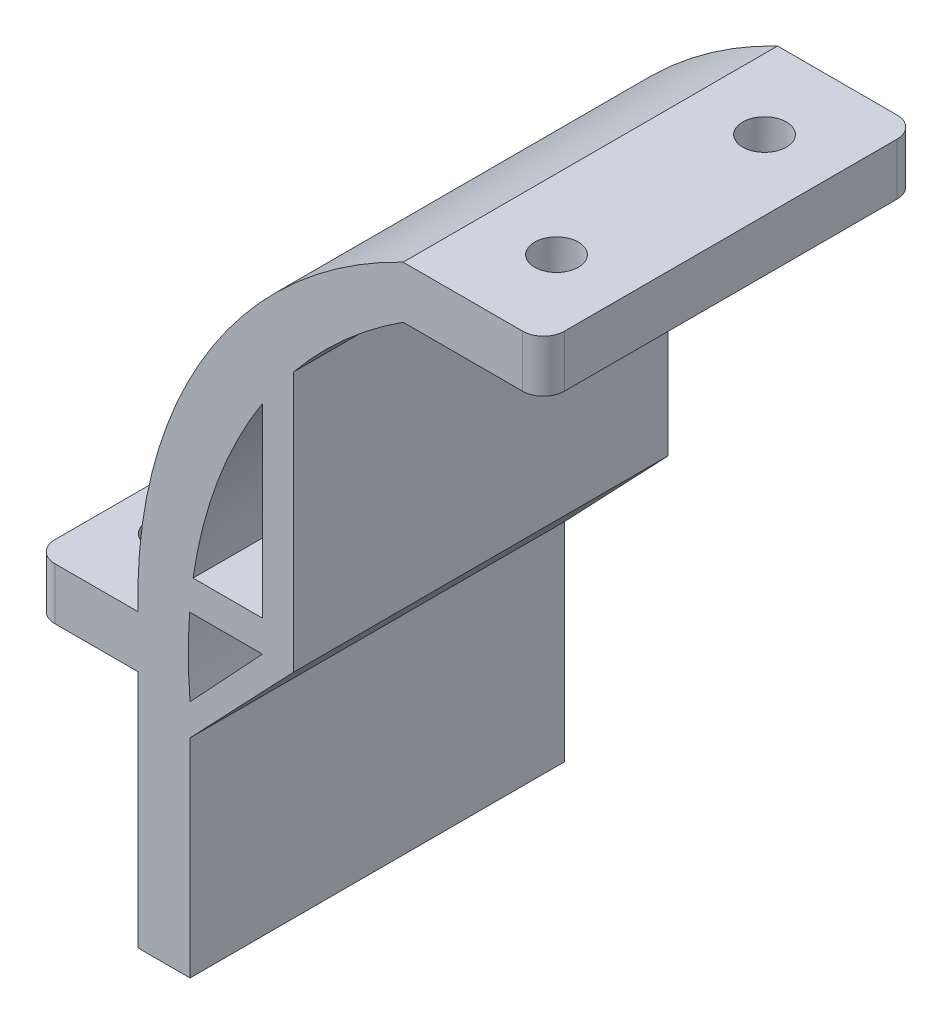
ISO-10303-21;
HEADER;
FILE_DESCRIPTION(('STEP AP214'),'2;1');
FILE_NAME('part.step','',(''),(''),'','','');
FILE_SCHEMA(('AUTOMOTIVE_DESIGN { 1 0 10303 214 1 1 1 1 }'));
ENDSEC;
DATA;
#1=APPLICATION_CONTEXT('core data for automotive mechanical design processes');
#2=APPLICATION_PROTOCOL_DEFINITION('international standard','automotive_design',2000,#1);
#3=PRODUCT_CONTEXT('',#1,'mechanical');
#4=PRODUCT('Part','Part','',(#3));
#5=PRODUCT_RELATED_PRODUCT_CATEGORY('part','',(#4));
#6=PRODUCT_DEFINITION_FORMATION('','',#4);
#7=PRODUCT_DEFINITION_CONTEXT('part definition',#1,'design');
#8=PRODUCT_DEFINITION('design','',#6,#7);
#9=PRODUCT_DEFINITION_SHAPE('','',#8);
#10=(LENGTH_UNIT() NAMED_UNIT(*) SI_UNIT(.MILLI.,.METRE.));
#11=(NAMED_UNIT(*) PLANE_ANGLE_UNIT() SI_UNIT($,.RADIAN.));
#12=(NAMED_UNIT(*) SI_UNIT($,.STERADIAN.) SOLID_ANGLE_UNIT());
#13=UNCERTAINTY_MEASURE_WITH_UNIT(LENGTH_MEASURE(1.E-05),#10,'distance_accuracy_value','');
#14=(GEOMETRIC_REPRESENTATION_CONTEXT(3) GLOBAL_UNCERTAINTY_ASSIGNED_CONTEXT((#13)) GLOBAL_UNIT_ASSIGNED_CONTEXT((#10,
#11,#12)) REPRESENTATION_CONTEXT('',''));
#15=CARTESIAN_POINT('',(0.,0.,0.));
#16=DIRECTION('',(0.,0.,1.));
#17=DIRECTION('',(1.,0.,0.));
#18=AXIS2_PLACEMENT_3D('',#15,#16,#17);
#19=CARTESIAN_POINT('',(19.2704077275692,219.412639915224,45.));
#20=DIRECTION('',(0.,0.,-1.));
#21=DIRECTION('',(-1.,0.,0.));
#22=AXIS2_PLACEMENT_3D('',#19,#20,#21);
#23=CYLINDRICAL_SURFACE('',#22,45.);
#24=CARTESIAN_POINT('',(19.2704077275692,219.412639915224,36.));
#25=DIRECTION('',(0.,0.,-1.));
#26=DIRECTION('',(-1.,0.,0.));
#27=AXIS2_PLACEMENT_3D('',#24,#25,#26);
#28=CIRCLE('',#27,45.);
#29=CARTESIAN_POINT('',(-25.2653617340679,225.859750776681,36.));
#30=VERTEX_POINT('',#29);
#31=CARTESIAN_POINT('',(-18.5973694260722,243.723778379767,36.));
#32=VERTEX_POINT('',#31);
#33=EDGE_CURVE('E315',#30,#32,#28,.T.);
#34=ORIENTED_EDGE('',*,*,#33,.F.);
#35=DIRECTION('',(0.,0.,1.));
#36=VECTOR('',#35,1.);
#37=CARTESIAN_POINT('',(-25.2653617340679,225.859750776681,0.));
#38=LINE('',#37,#36);
#39=CARTESIAN_POINT('',(-25.2653617340679,225.859750776681,0.));
#40=VERTEX_POINT('',#39);
#41=EDGE_CURVE('E404',#40,#30,#38,.T.);
#42=ORIENTED_EDGE('',*,*,#41,.F.);
#43=CARTESIAN_POINT('',(19.2704077275692,219.412639915224,0.));
#44=DIRECTION('',(0.,0.,1.));
#45=DIRECTION('',(1.,0.,0.));
#46=AXIS2_PLACEMENT_3D('',#43,#44,#45);
#47=CIRCLE('',#46,45.);
#48=CARTESIAN_POINT('',(-18.5973694260722,243.723778379767,0.));
#49=VERTEX_POINT('',#48);
#50=EDGE_CURVE('E416',#49,#40,#47,.T.);
#51=ORIENTED_EDGE('',*,*,#50,.F.);
#52=DIRECTION('',(0.,0.,1.));
#53=VECTOR('',#52,1.);
#54=CARTESIAN_POINT('',(-18.5973694260722,243.723778379767,0.));
#55=LINE('',#54,#53);
#56=EDGE_CURVE('E379',#49,#32,#55,.T.);
#57=ORIENTED_EDGE('',*,*,#56,.T.);
#58=EDGE_LOOP('',(#34,#42,#51,#57));
#59=FACE_BOUND('',#58,.T.);
#60=ADVANCED_FACE('F41',(#59),#23,.F.);
#61=CARTESIAN_POINT('',(19.2704077275692,219.412639915224,36.));
#62=DIRECTION('',(0.,0.,-1.));
#63=DIRECTION('',(-1.,0.,0.));
#64=AXIS2_PLACEMENT_3D('',#61,#62,#63);
#65=CIRCLE('',#64,45.);
#66=CARTESIAN_POINT('',(-25.5516147708674,215.414352888303,36.));
#67=VERTEX_POINT('',#66);
#68=CARTESIAN_POINT('',(-25.5973694260722,222.859750776681,36.));
#69=VERTEX_POINT('',#68);
#70=EDGE_CURVE('E324',#67,#69,#65,.T.);
#71=ORIENTED_EDGE('',*,*,#70,.F.);
#72=DIRECTION('',(0.,0.,-1.));
#73=VECTOR('',#72,1.);
#74=CARTESIAN_POINT('',(-25.5516147708674,215.414352888303,45.));
#75=LINE('',#74,#73);
#76=CARTESIAN_POINT('',(-25.5516147708674,215.414352888303,0.));
#77=VERTEX_POINT('',#76);
#78=EDGE_CURVE('E445',#67,#77,#75,.T.);
#79=ORIENTED_EDGE('',*,*,#78,.T.);
#80=CARTESIAN_POINT('',(-25.5973694260722,222.859750776681,0.));
#81=VERTEX_POINT('',#80);
#82=EDGE_CURVE('E383',#81,#77,#47,.T.);
#83=ORIENTED_EDGE('',*,*,#82,.F.);
#84=DIRECTION('',(0.,0.,1.));
#85=VECTOR('',#84,1.);
#86=CARTESIAN_POINT('',(-25.5973694260722,222.859750776681,0.));
#87=LINE('',#86,#85);
#88=EDGE_CURVE('E400',#81,#69,#87,.T.);
#89=ORIENTED_EDGE('',*,*,#88,.T.);
#90=EDGE_LOOP('',(#71,#79,#83,#89));
#91=FACE_BOUND('',#90,.T.);
#92=ADVANCED_FACE('F532',(#91),#23,.F.);
#93=CARTESIAN_POINT('',(-25.5516147708674,0.,45.));
#94=DIRECTION('',(1.,0.,0.));
#95=DIRECTION('',(0.,0.,-1.));
#96=AXIS2_PLACEMENT_3D('',#93,#94,#95);
#97=PLANE('',#96);
#98=DIRECTION('',(0.,1.,0.));
#99=VECTOR('',#98,1.);
#100=CARTESIAN_POINT('',(-25.5516147708674,0.,36.));
#101=LINE('',#100,#99);
#102=CARTESIAN_POINT('',(-25.5516147708674,192.414352888303,36.));
#103=VERTEX_POINT('',#102);
#104=CARTESIAN_POINT('',(-25.5516147708674,212.414352888303,36.));
#105=VERTEX_POINT('',#104);
#106=EDGE_CURVE('E337',#103,#105,#101,.T.);
#107=ORIENTED_EDGE('',*,*,#106,.F.);
#108=DIRECTION('',(0.,0.,-1.));
#109=VECTOR('',#108,1.);
#110=CARTESIAN_POINT('',(-25.5516147708674,192.414352888303,45.));
#111=LINE('',#110,#109);
#112=CARTESIAN_POINT('',(-25.5516147708674,192.414352888303,0.));
#113=VERTEX_POINT('',#112);
#114=EDGE_CURVE('E448',#103,#113,#111,.T.);
#115=ORIENTED_EDGE('',*,*,#114,.T.);
#116=DIRECTION('',(0.,-1.,0.));
#117=VECTOR('',#116,1.);
#118=CARTESIAN_POINT('',(-25.5516147708674,0.,0.));
#119=LINE('',#118,#117);
#120=CARTESIAN_POINT('',(-25.5516147708674,212.414352888303,0.));
#121=VERTEX_POINT('',#120);
#122=EDGE_CURVE('E441',#121,#113,#119,.T.);
#123=ORIENTED_EDGE('',*,*,#122,.F.);
#124=DIRECTION('',(0.,0.,1.));
#125=VECTOR('',#124,1.);
#126=CARTESIAN_POINT('',(-25.5516147708674,212.414352888303,0.));
#127=LINE('',#126,#125);
#128=EDGE_CURVE('E392',#121,#105,#127,.T.);
#129=ORIENTED_EDGE('',*,*,#128,.T.);
#130=EDGE_LOOP('',(#107,#115,#123,#129));
#131=FACE_BOUND('',#130,.T.);
#132=ADVANCED_FACE('F514',(#131),#97,.T.);
#133=CARTESIAN_POINT('',(19.2704077275692,219.412639915224,36.));
#134=DIRECTION('',(0.,0.,-1.));
#135=DIRECTION('',(-1.,0.,0.));
#136=AXIS2_PLACEMENT_3D('',#133,#134,#135);
#137=CIRCLE('',#136,45.);
#138=CARTESIAN_POINT('',(-15.5973694260722,247.859750776681,36.));
#139=VERTEX_POINT('',#138);
#140=CARTESIAN_POINT('',(-5.0651995300582,257.264696918807,36.));
#141=VERTEX_POINT('',#140);
#142=EDGE_CURVE('E334',#139,#141,#137,.T.);
#143=ORIENTED_EDGE('',*,*,#142,.F.);
#144=DIRECTION('',(0.,0.,1.));
#145=VECTOR('',#144,1.);
#146=CARTESIAN_POINT('',(-15.5973694260722,247.859750776681,0.));
#147=LINE('',#146,#145);
#148=CARTESIAN_POINT('',(-15.5973694260722,247.859750776681,0.));
#149=VERTEX_POINT('',#148);
#150=EDGE_CURVE('E384',#149,#139,#147,.T.);
#151=ORIENTED_EDGE('',*,*,#150,.F.);
#152=CARTESIAN_POINT('',(-5.06519953005821,257.264696918807,0.));
#153=VERTEX_POINT('',#152);
#154=EDGE_CURVE('E411',#153,#149,#47,.T.);
#155=ORIENTED_EDGE('',*,*,#154,.F.);
#156=DIRECTION('',(0.,0.,-1.));
#157=VECTOR('',#156,1.);
#158=CARTESIAN_POINT('',(-5.06519953005821,257.264696918807,45.));
#159=LINE('',#158,#157);
#160=EDGE_CURVE('E238',#141,#153,#159,.T.);
#161=ORIENTED_EDGE('',*,*,#160,.F.);
#162=EDGE_LOOP('',(#143,#151,#155,#161));
#163=FACE_BOUND('',#162,.T.);
#164=ADVANCED_FACE('F505',(#163),#23,.F.);
#165=CARTESIAN_POINT('',(0.,257.264696918807,45.));
#166=DIRECTION('',(0.,-1.,0.));
#167=DIRECTION('',(0.,0.,-1.));
#168=AXIS2_PLACEMENT_3D('',#165,#166,#167);
#169=PLANE('',#168);
#170=CARTESIAN_POINT('',(1.68480046994179,257.264696918807,8.));
#171=DIRECTION('',(0.,-1.,0.));
#172=DIRECTION('',(0.,0.,-1.));
#173=AXIS2_PLACEMENT_3D('',#170,#171,#172);
#174=CIRCLE('',#173,2.1);
#175=CARTESIAN_POINT('',(1.68480046994179,257.264696918807,5.9));
#176=VERTEX_POINT('',#175);
#177=EDGE_CURVE('E308',#176,#176,#174,.T.);
#178=ORIENTED_EDGE('',*,*,#177,.F.);
#179=EDGE_LOOP('',(#178));
#180=FACE_BOUND('',#179,.T.);
#181=CARTESIAN_POINT('',(1.68480046994179,257.264696918807,28.));
#182=DIRECTION('',(0.,-1.,0.));
#183=DIRECTION('',(0.,0.,-1.));
#184=AXIS2_PLACEMENT_3D('',#181,#182,#183);
#185=CIRCLE('',#184,2.1);
#186=CARTESIAN_POINT('',(1.68480046994179,257.264696918807,25.9));
#187=VERTEX_POINT('',#186);
#188=EDGE_CURVE('E730',#187,#187,#185,.T.);
#189=ORIENTED_EDGE('',*,*,#188,.F.);
#190=EDGE_LOOP('',(#189));
#191=FACE_BOUND('',#190,.T.);
#192=DIRECTION('',(0.,0.,-1.));
#193=VECTOR('',#192,1.);
#194=CARTESIAN_POINT('',(8.43480046994179,257.264696918807,45.));
#195=LINE('',#194,#193);
#196=CARTESIAN_POINT('',(8.43480046994179,257.264696918807,34.));
#197=VERTEX_POINT('',#196);
#198=CARTESIAN_POINT('',(8.43480046994179,257.264696918807,2.00000000000002));
#199=VERTEX_POINT('',#198);
#200=EDGE_CURVE('E230',#197,#199,#195,.T.);
#201=ORIENTED_EDGE('',*,*,#200,.F.);
#202=CARTESIAN_POINT('',(6.43480046994179,257.264696918807,34.));
#203=DIRECTION('',(0.,-1.,0.));
#204=DIRECTION('',(0.,0.,-1.));
#205=AXIS2_PLACEMENT_3D('',#202,#203,#204);
#206=CIRCLE('',#205,2.);
#207=CARTESIAN_POINT('',(6.43480046994179,257.264696918807,36.));
#208=VERTEX_POINT('',#207);
#209=EDGE_CURVE('E11',#197,#208,#206,.T.);
#210=ORIENTED_EDGE('',*,*,#209,.T.);
#211=DIRECTION('',(1.,0.,0.));
#212=VECTOR('',#211,1.);
#213=CARTESIAN_POINT('',(0.,257.264696918807,36.));
#214=LINE('',#213,#212);
#215=EDGE_CURVE('E348',#141,#208,#214,.T.);
#216=ORIENTED_EDGE('',*,*,#215,.F.);
#217=ORIENTED_EDGE('',*,*,#160,.T.);
#218=DIRECTION('',(-1.,0.,0.));
#219=VECTOR('',#218,1.);
#220=CARTESIAN_POINT('',(0.,257.264696918807,0.));
#221=LINE('',#220,#219);
#222=CARTESIAN_POINT('',(6.43480046994179,257.264696918807,0.));
#223=VERTEX_POINT('',#222);
#224=EDGE_CURVE('E415',#223,#153,#221,.T.);
#225=ORIENTED_EDGE('',*,*,#224,.F.);
#226=CARTESIAN_POINT('',(6.43480046994179,257.264696918807,2.));
#227=DIRECTION('',(0.,-1.,0.));
#228=DIRECTION('',(0.,0.,-1.));
#229=AXIS2_PLACEMENT_3D('',#226,#227,#228);
#230=CIRCLE('',#229,2.);
#231=EDGE_CURVE('E260',#223,#199,#230,.T.);
#232=ORIENTED_EDGE('',*,*,#231,.T.);
#233=EDGE_LOOP('',(#201,#210,#216,#217,#225,#232));
#234=FACE_BOUND('',#233,.T.);
#235=ADVANCED_FACE('F496',(#180,#191,#234),#169,.T.);
#236=CARTESIAN_POINT('',(8.43480046994179,0.,45.));
#237=DIRECTION('',(1.,0.,0.));
#238=DIRECTION('',(0.,0.,-1.));
#239=AXIS2_PLACEMENT_3D('',#236,#237,#238);
#240=PLANE('',#239);
#241=DIRECTION('',(0.,0.,-1.));
#242=VECTOR('',#241,1.);
#243=CARTESIAN_POINT('',(8.43480046994179,262.264696918807,45.));
#244=LINE('',#243,#242);
#245=CARTESIAN_POINT('',(8.43480046994179,262.264696918807,34.));
#246=VERTEX_POINT('',#245);
#247=CARTESIAN_POINT('',(8.43480046994179,262.264696918807,2.00000000000002));
#248=VERTEX_POINT('',#247);
#249=EDGE_CURVE('E226',#246,#248,#244,.T.);
#250=ORIENTED_EDGE('',*,*,#249,.F.);
#251=DIRECTION('',(0.,1.,0.));
#252=VECTOR('',#251,1.);
#253=CARTESIAN_POINT('',(8.43480046994179,257.264696918807,34.));
#254=LINE('',#253,#252);
#255=EDGE_CURVE('E51',#246,#197,#254,.F.);
#256=ORIENTED_EDGE('',*,*,#255,.T.);
#257=ORIENTED_EDGE('',*,*,#200,.T.);
#258=DIRECTION('',(0.,-1.,0.));
#259=VECTOR('',#258,1.);
#260=CARTESIAN_POINT('',(8.43480046994179,262.264696918807,2.));
#261=LINE('',#260,#259);
#262=EDGE_CURVE('E264',#199,#248,#261,.F.);
#263=ORIENTED_EDGE('',*,*,#262,.T.);
#264=EDGE_LOOP('',(#250,#256,#257,#263));
#265=FACE_BOUND('',#264,.T.);
#266=ADVANCED_FACE('F549',(#265),#240,.T.);
#267=CARTESIAN_POINT('',(0.,262.264696918807,45.));
#268=DIRECTION('',(0.,-1.,0.));
#269=DIRECTION('',(0.,0.,-1.));
#270=AXIS2_PLACEMENT_3D('',#267,#268,#269);
#271=PLANE('',#270);
#272=CARTESIAN_POINT('',(1.68480046994179,262.264696918807,8.));
#273=DIRECTION('',(0.,1.,0.));
#274=DIRECTION('',(0.,0.,1.));
#275=AXIS2_PLACEMENT_3D('',#272,#273,#274);
#276=CIRCLE('',#275,2.1);
#277=CARTESIAN_POINT('',(1.68480046994179,262.264696918807,10.1));
#278=VERTEX_POINT('',#277);
#279=EDGE_CURVE('E728',#278,#278,#276,.T.);
#280=ORIENTED_EDGE('',*,*,#279,.F.);
#281=EDGE_LOOP('',(#280));
#282=FACE_BOUND('',#281,.T.);
#283=CARTESIAN_POINT('',(1.68480046994179,262.264696918807,28.));
#284=DIRECTION('',(0.,1.,0.));
#285=DIRECTION('',(0.,0.,1.));
#286=AXIS2_PLACEMENT_3D('',#283,#284,#285);
#287=CIRCLE('',#286,2.1);
#288=CARTESIAN_POINT('',(1.68480046994179,262.264696918807,30.1));
#289=VERTEX_POINT('',#288);
#290=EDGE_CURVE('E731',#289,#289,#287,.T.);
#291=ORIENTED_EDGE('',*,*,#290,.F.);
#292=EDGE_LOOP('',(#291));
#293=FACE_BOUND('',#292,.T.);
#294=DIRECTION('',(-1.,0.,0.));
#295=VECTOR('',#294,1.);
#296=CARTESIAN_POINT('',(8.43480046994179,262.264696918807,36.));
#297=LINE('',#296,#295);
#298=CARTESIAN_POINT('',(6.43480046994179,262.264696918807,36.));
#299=VERTEX_POINT('',#298);
#300=CARTESIAN_POINT('',(-5.06519953005818,262.264696918807,36.));
#301=VERTEX_POINT('',#300);
#302=EDGE_CURVE('E196',#299,#301,#297,.T.);
#303=ORIENTED_EDGE('',*,*,#302,.F.);
#304=CARTESIAN_POINT('',(6.43480046994179,262.264696918807,34.));
#305=DIRECTION('',(0.,-1.,0.));
#306=DIRECTION('',(0.,0.,-1.));
#307=AXIS2_PLACEMENT_3D('',#304,#305,#306);
#308=CIRCLE('',#307,2.);
#309=EDGE_CURVE('E66',#299,#246,#308,.F.);
#310=ORIENTED_EDGE('',*,*,#309,.T.);
#311=ORIENTED_EDGE('',*,*,#249,.T.);
#312=CARTESIAN_POINT('',(6.43480046994179,262.264696918807,2.));
#313=DIRECTION('',(0.,-1.,0.));
#314=DIRECTION('',(0.,0.,-1.));
#315=AXIS2_PLACEMENT_3D('',#312,#313,#314);
#316=CIRCLE('',#315,2.);
#317=CARTESIAN_POINT('',(6.43480046994179,262.264696918807,0.));
#318=VERTEX_POINT('',#317);
#319=EDGE_CURVE('E268',#248,#318,#316,.F.);
#320=ORIENTED_EDGE('',*,*,#319,.T.);
#321=DIRECTION('',(-1.,0.,0.));
#322=VECTOR('',#321,1.);
#323=CARTESIAN_POINT('',(0.,262.264696918807,0.));
#324=LINE('',#323,#322);
#325=CARTESIAN_POINT('',(-5.06519953005821,262.264696918807,0.));
#326=VERTEX_POINT('',#325);
#327=EDGE_CURVE('E223',#318,#326,#324,.T.);
#328=ORIENTED_EDGE('',*,*,#327,.T.);
#329=DIRECTION('',(0.,0.,-1.));
#330=VECTOR('',#329,1.);
#331=CARTESIAN_POINT('',(-5.06519953005821,262.264696918807,45.));
#332=LINE('',#331,#330);
#333=EDGE_CURVE('E214',#301,#326,#332,.T.);
#334=ORIENTED_EDGE('',*,*,#333,.F.);
#335=EDGE_LOOP('',(#303,#310,#311,#320,#328,#334));
#336=FACE_BOUND('',#335,.T.);
#337=ADVANCED_FACE('F221',(#282,#293,#336),#271,.F.);
#338=CARTESIAN_POINT('',(14.4298215899234,221.70678583439,45.));
#339=DIRECTION('',(0.,0.,-1.));
#340=DIRECTION('',(-1.,0.,0.));
#341=AXIS2_PLACEMENT_3D('',#338,#339,#340);
#342=CYLINDRICAL_SURFACE('',#341,45.);
#343=CARTESIAN_POINT('',(14.4298215899234,221.70678583439,36.));
#344=DIRECTION('',(0.,0.,-1.));
#345=DIRECTION('',(-1.,0.,0.));
#346=AXIS2_PLACEMENT_3D('',#343,#344,#345);
#347=CIRCLE('',#346,45.);
#348=CARTESIAN_POINT('',(-30.5516147708674,220.414352888303,36.));
#349=VERTEX_POINT('',#348);
#350=EDGE_CURVE('E201',#301,#349,#347,.F.);
#351=ORIENTED_EDGE('',*,*,#350,.F.);
#352=ORIENTED_EDGE('',*,*,#333,.T.);
#353=CARTESIAN_POINT('',(14.4298215899234,221.70678583439,0.));
#354=DIRECTION('',(0.,0.,1.));
#355=DIRECTION('',(1.,0.,0.));
#356=AXIS2_PLACEMENT_3D('',#353,#354,#355);
#357=CIRCLE('',#356,45.);
#358=CARTESIAN_POINT('',(-30.5516147708674,220.414352888303,0.));
#359=VERTEX_POINT('',#358);
#360=EDGE_CURVE('E422',#359,#326,#357,.F.);
#361=ORIENTED_EDGE('',*,*,#360,.F.);
#362=DIRECTION('',(0.,0.,-1.));
#363=VECTOR('',#362,1.);
#364=CARTESIAN_POINT('',(-30.5516147708674,220.414352888303,45.));
#365=LINE('',#364,#363);
#366=EDGE_CURVE('E216',#349,#359,#365,.T.);
#367=ORIENTED_EDGE('',*,*,#366,.F.);
#368=EDGE_LOOP('',(#351,#352,#361,#367));
#369=FACE_BOUND('',#368,.T.);
#370=ADVANCED_FACE('F212',(#369),#342,.T.);
#371=CARTESIAN_POINT('',(0.,220.414352888303,45.));
#372=DIRECTION('',(0.,1.,0.));
#373=DIRECTION('',(0.,0.,1.));
#374=AXIS2_PLACEMENT_3D('',#371,#372,#373);
#375=PLANE('',#374);
#376=CARTESIAN_POINT('',(-35.5516147708674,220.414352888303,8.));
#377=DIRECTION('',(0.,1.,0.));
#378=DIRECTION('',(0.,0.,1.));
#379=AXIS2_PLACEMENT_3D('',#376,#377,#378);
#380=CIRCLE('',#379,2.1);
#381=CARTESIAN_POINT('',(-35.5516147708674,220.414352888303,10.1));
#382=VERTEX_POINT('',#381);
#383=EDGE_CURVE('E295',#382,#382,#380,.T.);
#384=ORIENTED_EDGE('',*,*,#383,.F.);
#385=EDGE_LOOP('',(#384));
#386=FACE_BOUND('',#385,.T.);
#387=CARTESIAN_POINT('',(-35.5516147708674,220.414352888303,28.));
#388=DIRECTION('',(0.,1.,0.));
#389=DIRECTION('',(0.,0.,1.));
#390=AXIS2_PLACEMENT_3D('',#387,#388,#389);
#391=CIRCLE('',#390,2.1);
#392=CARTESIAN_POINT('',(-35.5516147708674,220.414352888303,30.1));
#393=VERTEX_POINT('',#392);
#394=EDGE_CURVE('E302',#393,#393,#391,.T.);
#395=ORIENTED_EDGE('',*,*,#394,.F.);
#396=EDGE_LOOP('',(#395));
#397=FACE_BOUND('',#396,.T.);
#398=DIRECTION('',(0.,0.,-1.));
#399=VECTOR('',#398,1.);
#400=CARTESIAN_POINT('',(-40.5516147708674,220.414352888303,45.));
#401=LINE('',#400,#399);
#402=CARTESIAN_POINT('',(-40.5516147708674,220.414352888303,34.));
#403=VERTEX_POINT('',#402);
#404=CARTESIAN_POINT('',(-40.5516147708674,220.414352888303,2.00000000000002));
#405=VERTEX_POINT('',#404);
#406=EDGE_CURVE('E232',#403,#405,#401,.T.);
#407=ORIENTED_EDGE('',*,*,#406,.F.);
#408=CARTESIAN_POINT('',(-38.5516147708674,220.414352888303,34.));
#409=DIRECTION('',(0.,1.,0.));
#410=DIRECTION('',(0.,0.,1.));
#411=AXIS2_PLACEMENT_3D('',#408,#409,#410);
#412=CIRCLE('',#411,2.);
#413=CARTESIAN_POINT('',(-38.5516147708674,220.414352888303,36.));
#414=VERTEX_POINT('',#413);
#415=EDGE_CURVE('E286',#403,#414,#412,.T.);
#416=ORIENTED_EDGE('',*,*,#415,.T.);
#417=DIRECTION('',(-1.,0.,0.));
#418=VECTOR('',#417,1.);
#419=CARTESIAN_POINT('',(0.,220.414352888303,36.));
#420=LINE('',#419,#418);
#421=EDGE_CURVE('E219',#349,#414,#420,.T.);
#422=ORIENTED_EDGE('',*,*,#421,.F.);
#423=ORIENTED_EDGE('',*,*,#366,.T.);
#424=DIRECTION('',(1.,0.,0.));
#425=VECTOR('',#424,1.);
#426=CARTESIAN_POINT('',(0.,220.414352888303,0.));
#427=LINE('',#426,#425);
#428=CARTESIAN_POINT('',(-38.5516147708674,220.414352888303,0.));
#429=VERTEX_POINT('',#428);
#430=EDGE_CURVE('E425',#429,#359,#427,.T.);
#431=ORIENTED_EDGE('',*,*,#430,.F.);
#432=CARTESIAN_POINT('',(-38.5516147708674,220.414352888303,2.));
#433=DIRECTION('',(0.,1.,0.));
#434=DIRECTION('',(0.,0.,1.));
#435=AXIS2_PLACEMENT_3D('',#432,#433,#434);
#436=CIRCLE('',#435,2.);
#437=EDGE_CURVE('E245',#429,#405,#436,.T.);
#438=ORIENTED_EDGE('',*,*,#437,.T.);
#439=EDGE_LOOP('',(#407,#416,#422,#423,#431,#438));
#440=FACE_BOUND('',#439,.T.);
#441=ADVANCED_FACE('F470',(#386,#397,#440),#375,.T.);
#442=CARTESIAN_POINT('',(-40.5516147708674,0.,45.));
#443=DIRECTION('',(-1.,0.,0.));
#444=DIRECTION('',(0.,0.,1.));
#445=AXIS2_PLACEMENT_3D('',#442,#443,#444);
#446=PLANE('',#445);
#447=DIRECTION('',(0.,0.,-1.));
#448=VECTOR('',#447,1.);
#449=CARTESIAN_POINT('',(-40.5516147708674,215.414352888303,45.));
#450=LINE('',#449,#448);
#451=CARTESIAN_POINT('',(-40.5516147708674,215.414352888303,34.));
#452=VERTEX_POINT('',#451);
#453=CARTESIAN_POINT('',(-40.5516147708674,215.414352888303,2.00000000000002));
#454=VERTEX_POINT('',#453);
#455=EDGE_CURVE('E457',#452,#454,#450,.T.);
#456=ORIENTED_EDGE('',*,*,#455,.F.);
#457=DIRECTION('',(0.,-1.,0.));
#458=VECTOR('',#457,1.);
#459=CARTESIAN_POINT('',(-40.5516147708674,220.414352888303,34.));
#460=LINE('',#459,#458);
#461=EDGE_CURVE('E283',#452,#403,#460,.F.);
#462=ORIENTED_EDGE('',*,*,#461,.T.);
#463=ORIENTED_EDGE('',*,*,#406,.T.);
#464=DIRECTION('',(0.,1.,0.));
#465=VECTOR('',#464,1.);
#466=CARTESIAN_POINT('',(-40.5516147708674,215.414352888303,2.));
#467=LINE('',#466,#465);
#468=EDGE_CURVE('E241',#405,#454,#467,.F.);
#469=ORIENTED_EDGE('',*,*,#468,.T.);
#470=EDGE_LOOP('',(#456,#462,#463,#469));
#471=FACE_BOUND('',#470,.T.);
#472=ADVANCED_FACE('F463',(#471),#446,.T.);
#473=CARTESIAN_POINT('',(0.,215.414352888303,45.));
#474=DIRECTION('',(0.,1.,0.));
#475=DIRECTION('',(0.,0.,1.));
#476=AXIS2_PLACEMENT_3D('',#473,#474,#475);
#477=PLANE('',#476);
#478=CARTESIAN_POINT('',(-35.5516147708674,215.414352888303,8.));
#479=DIRECTION('',(0.,1.,0.));
#480=DIRECTION('',(0.,0.,1.));
#481=AXIS2_PLACEMENT_3D('',#478,#479,#480);
#482=CIRCLE('',#481,2.1);
#483=CARTESIAN_POINT('',(-35.5516147708674,215.414352888303,10.1));
#484=VERTEX_POINT('',#483);
#485=EDGE_CURVE('E45',#484,#484,#482,.T.);
#486=ORIENTED_EDGE('',*,*,#485,.T.);
#487=EDGE_LOOP('',(#486));
#488=FACE_BOUND('',#487,.T.);
#489=CARTESIAN_POINT('',(-35.5516147708674,215.414352888303,28.));
#490=DIRECTION('',(0.,1.,0.));
#491=DIRECTION('',(0.,0.,1.));
#492=AXIS2_PLACEMENT_3D('',#489,#490,#491);
#493=CIRCLE('',#492,2.1);
#494=CARTESIAN_POINT('',(-35.5516147708674,215.414352888303,30.1));
#495=VERTEX_POINT('',#494);
#496=EDGE_CURVE('E292',#495,#495,#493,.T.);
#497=ORIENTED_EDGE('',*,*,#496,.T.);
#498=EDGE_LOOP('',(#497));
#499=FACE_BOUND('',#498,.T.);
#500=DIRECTION('',(-1.,0.,0.));
#501=VECTOR('',#500,1.);
#502=CARTESIAN_POINT('',(0.,215.414352888303,36.));
#503=LINE('',#502,#501);
#504=CARTESIAN_POINT('',(-30.5516147708674,215.414352888303,36.));
#505=VERTEX_POINT('',#504);
#506=CARTESIAN_POINT('',(-38.5516147708674,215.414352888303,36.));
#507=VERTEX_POINT('',#506);
#508=EDGE_CURVE('E218',#505,#507,#503,.T.);
#509=ORIENTED_EDGE('',*,*,#508,.T.);
#510=CARTESIAN_POINT('',(-38.5516147708674,215.414352888303,34.));
#511=DIRECTION('',(0.,1.,0.));
#512=DIRECTION('',(0.,0.,1.));
#513=AXIS2_PLACEMENT_3D('',#510,#511,#512);
#514=CIRCLE('',#513,2.);
#515=EDGE_CURVE('E280',#507,#452,#514,.F.);
#516=ORIENTED_EDGE('',*,*,#515,.T.);
#517=ORIENTED_EDGE('',*,*,#455,.T.);
#518=CARTESIAN_POINT('',(-38.5516147708674,215.414352888303,2.));
#519=DIRECTION('',(0.,1.,0.));
#520=DIRECTION('',(0.,0.,1.));
#521=AXIS2_PLACEMENT_3D('',#518,#519,#520);
#522=CIRCLE('',#521,2.);
#523=CARTESIAN_POINT('',(-38.5516147708674,215.414352888303,0.));
#524=VERTEX_POINT('',#523);
#525=EDGE_CURVE('E249',#454,#524,#522,.F.);
#526=ORIENTED_EDGE('',*,*,#525,.T.);
#527=DIRECTION('',(1.,0.,0.));
#528=VECTOR('',#527,1.);
#529=CARTESIAN_POINT('',(0.,215.414352888303,0.));
#530=LINE('',#529,#528);
#531=CARTESIAN_POINT('',(-30.5516147708674,215.414352888303,0.));
#532=VERTEX_POINT('',#531);
#533=EDGE_CURVE('E429',#524,#532,#530,.T.);
#534=ORIENTED_EDGE('',*,*,#533,.T.);
#535=DIRECTION('',(0.,0.,-1.));
#536=VECTOR('',#535,1.);
#537=CARTESIAN_POINT('',(-30.5516147708674,215.414352888303,45.));
#538=LINE('',#537,#536);
#539=EDGE_CURVE('E454',#505,#532,#538,.T.);
#540=ORIENTED_EDGE('',*,*,#539,.F.);
#541=EDGE_LOOP('',(#509,#516,#517,#526,#534,#540));
#542=FACE_BOUND('',#541,.T.);
#543=ADVANCED_FACE('F476',(#488,#499,#542),#477,.F.);
#544=CARTESIAN_POINT('',(-30.5516147708674,0.,45.));
#545=DIRECTION('',(1.,0.,0.));
#546=DIRECTION('',(0.,0.,-1.));
#547=AXIS2_PLACEMENT_3D('',#544,#545,#546);
#548=PLANE('',#547);
#549=DIRECTION('',(0.,0.,-1.));
#550=VECTOR('',#549,1.);
#551=CARTESIAN_POINT('',(-30.5516147708674,192.414352888303,45.));
#552=LINE('',#551,#550);
#553=CARTESIAN_POINT('',(-30.5516147708674,192.414352888303,36.));
#554=VERTEX_POINT('',#553);
#555=CARTESIAN_POINT('',(-30.5516147708674,192.414352888303,0.));
#556=VERTEX_POINT('',#555);
#557=EDGE_CURVE('E451',#554,#556,#552,.T.);
#558=ORIENTED_EDGE('',*,*,#557,.F.);
#559=DIRECTION('',(0.,1.,0.));
#560=VECTOR('',#559,1.);
#561=CARTESIAN_POINT('',(-30.5516147708674,0.,36.));
#562=LINE('',#561,#560);
#563=EDGE_CURVE('E344',#554,#505,#562,.T.);
#564=ORIENTED_EDGE('',*,*,#563,.T.);
#565=ORIENTED_EDGE('',*,*,#539,.T.);
#566=DIRECTION('',(0.,-1.,0.));
#567=VECTOR('',#566,1.);
#568=CARTESIAN_POINT('',(-30.5516147708674,0.,0.));
#569=LINE('',#568,#567);
#570=EDGE_CURVE('E433',#532,#556,#569,.T.);
#571=ORIENTED_EDGE('',*,*,#570,.T.);
#572=EDGE_LOOP('',(#558,#564,#565,#571));
#573=FACE_BOUND('',#572,.T.);
#574=ADVANCED_FACE('F485',(#573),#548,.F.);
#575=CARTESIAN_POINT('',(0.,192.414352888303,45.));
#576=DIRECTION('',(0.,1.,0.));
#577=DIRECTION('',(0.,0.,1.));
#578=AXIS2_PLACEMENT_3D('',#575,#576,#577);
#579=PLANE('',#578);
#580=ORIENTED_EDGE('',*,*,#114,.F.);
#581=DIRECTION('',(-1.,0.,0.));
#582=VECTOR('',#581,1.);
#583=CARTESIAN_POINT('',(0.,192.414352888303,36.));
#584=LINE('',#583,#582);
#585=EDGE_CURVE('E340',#103,#554,#584,.T.);
#586=ORIENTED_EDGE('',*,*,#585,.T.);
#587=ORIENTED_EDGE('',*,*,#557,.T.);
#588=DIRECTION('',(1.,0.,0.));
#589=VECTOR('',#588,1.);
#590=CARTESIAN_POINT('',(0.,192.414352888303,0.));
#591=LINE('',#590,#589);
#592=EDGE_CURVE('E437',#556,#113,#591,.T.);
#593=ORIENTED_EDGE('',*,*,#592,.T.);
#594=EDGE_LOOP('',(#580,#586,#587,#593));
#595=FACE_BOUND('',#594,.T.);
#596=ADVANCED_FACE('F517',(#595),#579,.F.);
#597=CARTESIAN_POINT('',(0.,0.,0.));
#598=DIRECTION('',(0.,0.,1.));
#599=DIRECTION('',(1.,0.,0.));
#600=AXIS2_PLACEMENT_3D('',#597,#598,#599);
#601=PLANE('',#600);
#602=ORIENTED_EDGE('',*,*,#154,.T.);
#603=DIRECTION('',(0.,1.,0.));
#604=VECTOR('',#603,1.);
#605=CARTESIAN_POINT('',(-15.5973694260722,0.,0.));
#606=LINE('',#605,#604);
#607=CARTESIAN_POINT('',(-15.5973694260722,222.859750776681,0.));
#608=VERTEX_POINT('',#607);
#609=EDGE_CURVE('E375',#608,#149,#606,.T.);
#610=ORIENTED_EDGE('',*,*,#609,.F.);
#611=DIRECTION('',(-0.68988218010904,-0.723921665353371,0.));
#612=VECTOR('',#611,1.);
#613=CARTESIAN_POINT('',(-119.474760714532,113.856943830399,0.));
#614=LINE('',#613,#612);
#615=EDGE_CURVE('E371',#608,#121,#614,.T.);
#616=ORIENTED_EDGE('',*,*,#615,.T.);
#617=ORIENTED_EDGE('',*,*,#122,.T.);
#618=ORIENTED_EDGE('',*,*,#592,.F.);
#619=ORIENTED_EDGE('',*,*,#570,.F.);
#620=ORIENTED_EDGE('',*,*,#533,.F.);
#621=DIRECTION('',(0.,1.,0.));
#622=VECTOR('',#621,1.);
#623=CARTESIAN_POINT('',(-38.5516147708674,220.414352888303,0.));
#624=LINE('',#623,#622);
#625=EDGE_CURVE('E256',#524,#429,#624,.T.);
#626=ORIENTED_EDGE('',*,*,#625,.T.);
#627=ORIENTED_EDGE('',*,*,#430,.T.);
#628=ORIENTED_EDGE('',*,*,#360,.T.);
#629=ORIENTED_EDGE('',*,*,#327,.F.);
#630=DIRECTION('',(0.,-1.,0.));
#631=VECTOR('',#630,1.);
#632=CARTESIAN_POINT('',(6.43480046994179,257.264696918807,0.));
#633=LINE('',#632,#631);
#634=EDGE_CURVE('E252',#318,#223,#633,.T.);
#635=ORIENTED_EDGE('',*,*,#634,.T.);
#636=ORIENTED_EDGE('',*,*,#224,.T.);
#637=EDGE_LOOP('',(#602,#610,#616,#617,#618,#619,#620,#626,#627,#628,#629,#635,#636));
#638=FACE_BOUND('',#637,.T.);
#639=DIRECTION('',(0.,-1.,0.));
#640=VECTOR('',#639,1.);
#641=CARTESIAN_POINT('',(-18.5973694260721,0.,0.));
#642=LINE('',#641,#640);
#643=CARTESIAN_POINT('',(-18.5973694260722,225.859750776681,0.));
#644=VERTEX_POINT('',#643);
#645=EDGE_CURVE('E352',#49,#644,#642,.T.);
#646=ORIENTED_EDGE('',*,*,#645,.F.);
#647=ORIENTED_EDGE('',*,*,#50,.T.);
#648=DIRECTION('',(-1.,0.,0.));
#649=VECTOR('',#648,1.);
#650=CARTESIAN_POINT('',(0.,225.859750776681,0.));
#651=LINE('',#650,#649);
#652=EDGE_CURVE('E360',#644,#40,#651,.T.);
#653=ORIENTED_EDGE('',*,*,#652,.F.);
#654=EDGE_LOOP('',(#646,#647,#653));
#655=FACE_BOUND('',#654,.T.);
#656=ORIENTED_EDGE('',*,*,#82,.T.);
#657=DIRECTION('',(-0.682591367762052,-0.730800263175056,0.));
#658=VECTOR('',#657,1.);
#659=CARTESIAN_POINT('',(-121.103180433286,113.114334706377,0.));
#660=LINE('',#659,#658);
#661=CARTESIAN_POINT('',(-18.5973694260722,222.859750776681,0.));
#662=VERTEX_POINT('',#661);
#663=EDGE_CURVE('E367',#662,#77,#660,.T.);
#664=ORIENTED_EDGE('',*,*,#663,.F.);
#665=DIRECTION('',(1.,0.,0.));
#666=VECTOR('',#665,1.);
#667=CARTESIAN_POINT('',(0.,222.859750776681,0.));
#668=LINE('',#667,#666);
#669=EDGE_CURVE('E363',#81,#662,#668,.T.);
#670=ORIENTED_EDGE('',*,*,#669,.F.);
#671=EDGE_LOOP('',(#656,#664,#670));
#672=FACE_BOUND('',#671,.T.);
#673=ADVANCED_FACE('F480',(#638,#655,#672),#601,.F.);
#674=CARTESIAN_POINT('',(-38.5516147708674,0.,2.));
#675=DIRECTION('',(0.,-1.,0.));
#676=DIRECTION('',(0.,0.,-1.));
#677=AXIS2_PLACEMENT_3D('',#674,#675,#676);
#678=CYLINDRICAL_SURFACE('',#677,2.);
#679=ORIENTED_EDGE('',*,*,#525,.F.);
#680=ORIENTED_EDGE('',*,*,#468,.F.);
#681=ORIENTED_EDGE('',*,*,#437,.F.);
#682=ORIENTED_EDGE('',*,*,#625,.F.);
#683=EDGE_LOOP('',(#679,#680,#681,#682));
#684=FACE_BOUND('',#683,.T.);
#685=ADVANCED_FACE('F473',(#684),#678,.T.);
#686=CARTESIAN_POINT('',(6.43480046994179,0.,2.));
#687=DIRECTION('',(0.,1.,0.));
#688=DIRECTION('',(0.,0.,1.));
#689=AXIS2_PLACEMENT_3D('',#686,#687,#688);
#690=CYLINDRICAL_SURFACE('',#689,2.);
#691=ORIENTED_EDGE('',*,*,#319,.F.);
#692=ORIENTED_EDGE('',*,*,#262,.F.);
#693=ORIENTED_EDGE('',*,*,#231,.F.);
#694=ORIENTED_EDGE('',*,*,#634,.F.);
#695=EDGE_LOOP('',(#691,#692,#693,#694));
#696=FACE_BOUND('',#695,.T.);
#697=ADVANCED_FACE('F493',(#696),#690,.T.);
#698=CARTESIAN_POINT('',(-18.5973694260721,0.,0.));
#699=DIRECTION('',(-1.,0.,0.));
#700=DIRECTION('',(0.,-1.,0.));
#701=AXIS2_PLACEMENT_3D('',#698,#699,#700);
#702=PLANE('',#701);
#703=DIRECTION('',(0.,-1.,0.));
#704=VECTOR('',#703,1.);
#705=CARTESIAN_POINT('',(-18.5973694260721,0.,36.));
#706=LINE('',#705,#704);
#707=CARTESIAN_POINT('',(-18.5973694260722,225.859750776681,36.));
#708=VERTEX_POINT('',#707);
#709=EDGE_CURVE('E208',#32,#708,#706,.T.);
#710=ORIENTED_EDGE('',*,*,#709,.F.);
#711=ORIENTED_EDGE('',*,*,#56,.F.);
#712=ORIENTED_EDGE('',*,*,#645,.T.);
#713=DIRECTION('',(0.,0.,1.));
#714=VECTOR('',#713,1.);
#715=CARTESIAN_POINT('',(-18.5973694260722,225.859750776681,0.));
#716=LINE('',#715,#714);
#717=EDGE_CURVE('E378',#644,#708,#716,.T.);
#718=ORIENTED_EDGE('',*,*,#717,.T.);
#719=EDGE_LOOP('',(#710,#711,#712,#718));
#720=FACE_BOUND('',#719,.T.);
#721=ADVANCED_FACE('F529',(#720),#702,.T.);
#722=CARTESIAN_POINT('',(-15.5973694260722,0.,0.));
#723=DIRECTION('',(1.,0.,0.));
#724=DIRECTION('',(0.,0.,-1.));
#725=AXIS2_PLACEMENT_3D('',#722,#723,#724);
#726=PLANE('',#725);
#727=DIRECTION('',(0.,1.,0.));
#728=VECTOR('',#727,1.);
#729=CARTESIAN_POINT('',(-15.5973694260722,0.,36.));
#730=LINE('',#729,#728);
#731=CARTESIAN_POINT('',(-15.5973694260722,222.859750776681,36.));
#732=VERTEX_POINT('',#731);
#733=EDGE_CURVE('E331',#732,#139,#730,.T.);
#734=ORIENTED_EDGE('',*,*,#733,.F.);
#735=DIRECTION('',(0.,0.,1.));
#736=VECTOR('',#735,1.);
#737=CARTESIAN_POINT('',(-15.5973694260722,222.859750776681,0.));
#738=LINE('',#737,#736);
#739=EDGE_CURVE('E388',#608,#732,#738,.T.);
#740=ORIENTED_EDGE('',*,*,#739,.F.);
#741=ORIENTED_EDGE('',*,*,#609,.T.);
#742=ORIENTED_EDGE('',*,*,#150,.T.);
#743=EDGE_LOOP('',(#734,#740,#741,#742));
#744=FACE_BOUND('',#743,.T.);
#745=ADVANCED_FACE('F508',(#744),#726,.T.);
#746=CARTESIAN_POINT('',(-119.474760714532,113.856943830399,0.));
#747=DIRECTION('',(-0.723921665353371,0.68988218010904,0.));
#748=DIRECTION('',(-0.68988218010904,-0.723921665353371,0.));
#749=AXIS2_PLACEMENT_3D('',#746,#747,#748);
#750=PLANE('',#749);
#751=ORIENTED_EDGE('',*,*,#739,.T.);
#752=DIRECTION('',(-0.68988218010904,-0.723921665353371,0.));
#753=VECTOR('',#752,1.);
#754=CARTESIAN_POINT('',(-119.474760714532,113.856943830399,36.));
#755=LINE('',#754,#753);
#756=EDGE_CURVE('E327',#732,#105,#755,.T.);
#757=ORIENTED_EDGE('',*,*,#756,.T.);
#758=ORIENTED_EDGE('',*,*,#128,.F.);
#759=ORIENTED_EDGE('',*,*,#615,.F.);
#760=EDGE_LOOP('',(#751,#757,#758,#759));
#761=FACE_BOUND('',#760,.T.);
#762=ADVANCED_FACE('F518',(#761),#750,.F.);
#763=CARTESIAN_POINT('',(-121.103180433286,113.114334706377,0.));
#764=DIRECTION('',(-0.730800263175056,0.682591367762052,0.));
#765=DIRECTION('',(-0.682591367762052,-0.730800263175056,0.));
#766=AXIS2_PLACEMENT_3D('',#763,#764,#765);
#767=PLANE('',#766);
#768=DIRECTION('',(-0.682591367762052,-0.730800263175056,0.));
#769=VECTOR('',#768,1.);
#770=CARTESIAN_POINT('',(-121.103180433286,113.114334706377,36.));
#771=LINE('',#770,#769);
#772=CARTESIAN_POINT('',(-18.5973694260722,222.859750776681,36.));
#773=VERTEX_POINT('',#772);
#774=EDGE_CURVE('E321',#773,#67,#771,.T.);
#775=ORIENTED_EDGE('',*,*,#774,.F.);
#776=DIRECTION('',(0.,0.,1.));
#777=VECTOR('',#776,1.);
#778=CARTESIAN_POINT('',(-18.5973694260722,222.859750776681,0.));
#779=LINE('',#778,#777);
#780=EDGE_CURVE('E396',#662,#773,#779,.T.);
#781=ORIENTED_EDGE('',*,*,#780,.F.);
#782=ORIENTED_EDGE('',*,*,#663,.T.);
#783=ORIENTED_EDGE('',*,*,#78,.F.);
#784=EDGE_LOOP('',(#775,#781,#782,#783));
#785=FACE_BOUND('',#784,.T.);
#786=ADVANCED_FACE('F520',(#785),#767,.T.);
#787=CARTESIAN_POINT('',(0.,222.859750776681,0.));
#788=DIRECTION('',(0.,-1.,0.));
#789=DIRECTION('',(0.,0.,-1.));
#790=AXIS2_PLACEMENT_3D('',#787,#788,#789);
#791=PLANE('',#790);
#792=DIRECTION('',(1.,0.,0.));
#793=VECTOR('',#792,1.);
#794=CARTESIAN_POINT('',(0.,222.859750776681,36.));
#795=LINE('',#794,#793);
#796=EDGE_CURVE('E318',#69,#773,#795,.T.);
#797=ORIENTED_EDGE('',*,*,#796,.F.);
#798=ORIENTED_EDGE('',*,*,#88,.F.);
#799=ORIENTED_EDGE('',*,*,#669,.T.);
#800=ORIENTED_EDGE('',*,*,#780,.T.);
#801=EDGE_LOOP('',(#797,#798,#799,#800));
#802=FACE_BOUND('',#801,.T.);
#803=ADVANCED_FACE('F526',(#802),#791,.T.);
#804=CARTESIAN_POINT('',(0.,225.859750776681,0.));
#805=DIRECTION('',(0.,1.,0.));
#806=DIRECTION('',(0.,0.,1.));
#807=AXIS2_PLACEMENT_3D('',#804,#805,#806);
#808=PLANE('',#807);
#809=DIRECTION('',(-1.,0.,0.));
#810=VECTOR('',#809,1.);
#811=CARTESIAN_POINT('',(0.,225.859750776681,36.));
#812=LINE('',#811,#810);
#813=EDGE_CURVE('E271',#708,#30,#812,.T.);
#814=ORIENTED_EDGE('',*,*,#813,.F.);
#815=ORIENTED_EDGE('',*,*,#717,.F.);
#816=ORIENTED_EDGE('',*,*,#652,.T.);
#817=ORIENTED_EDGE('',*,*,#41,.T.);
#818=EDGE_LOOP('',(#814,#815,#816,#817));
#819=FACE_BOUND('',#818,.T.);
#820=ADVANCED_FACE('F590',(#819),#808,.T.);
#821=CARTESIAN_POINT('',(0.,0.,36.));
#822=DIRECTION('',(0.,0.,-1.));
#823=DIRECTION('',(-1.,0.,0.));
#824=AXIS2_PLACEMENT_3D('',#821,#822,#823);
#825=PLANE('',#824);
#826=ORIENTED_EDGE('',*,*,#421,.T.);
#827=DIRECTION('',(0.,-1.,0.));
#828=VECTOR('',#827,1.);
#829=CARTESIAN_POINT('',(-38.5516147708674,215.414352888303,36.));
#830=LINE('',#829,#828);
#831=EDGE_CURVE('E276',#414,#507,#830,.T.);
#832=ORIENTED_EDGE('',*,*,#831,.T.);
#833=ORIENTED_EDGE('',*,*,#508,.F.);
#834=ORIENTED_EDGE('',*,*,#563,.F.);
#835=ORIENTED_EDGE('',*,*,#585,.F.);
#836=ORIENTED_EDGE('',*,*,#106,.T.);
#837=ORIENTED_EDGE('',*,*,#756,.F.);
#838=ORIENTED_EDGE('',*,*,#733,.T.);
#839=ORIENTED_EDGE('',*,*,#142,.T.);
#840=ORIENTED_EDGE('',*,*,#215,.T.);
#841=DIRECTION('',(0.,1.,0.));
#842=VECTOR('',#841,1.);
#843=CARTESIAN_POINT('',(6.43480046994179,262.264696918807,36.));
#844=LINE('',#843,#842);
#845=EDGE_CURVE('E205',#208,#299,#844,.T.);
#846=ORIENTED_EDGE('',*,*,#845,.T.);
#847=ORIENTED_EDGE('',*,*,#302,.T.);
#848=ORIENTED_EDGE('',*,*,#350,.T.);
#849=EDGE_LOOP('',(#826,#832,#833,#834,#835,#836,#837,#838,#839,#840,#846,#847,#848));
#850=FACE_BOUND('',#849,.T.);
#851=ORIENTED_EDGE('',*,*,#70,.T.);
#852=ORIENTED_EDGE('',*,*,#796,.T.);
#853=ORIENTED_EDGE('',*,*,#774,.T.);
#854=EDGE_LOOP('',(#851,#852,#853));
#855=FACE_BOUND('',#854,.T.);
#856=ORIENTED_EDGE('',*,*,#33,.T.);
#857=ORIENTED_EDGE('',*,*,#709,.T.);
#858=ORIENTED_EDGE('',*,*,#813,.T.);
#859=EDGE_LOOP('',(#856,#857,#858));
#860=FACE_BOUND('',#859,.T.);
#861=ADVANCED_FACE('F199',(#850,#855,#860),#825,.F.);
#862=CARTESIAN_POINT('',(-38.5516147708674,0.,34.));
#863=DIRECTION('',(0.,1.,0.));
#864=DIRECTION('',(0.,0.,1.));
#865=AXIS2_PLACEMENT_3D('',#862,#863,#864);
#866=CYLINDRICAL_SURFACE('',#865,2.);
#867=ORIENTED_EDGE('',*,*,#415,.F.);
#868=ORIENTED_EDGE('',*,*,#461,.F.);
#869=ORIENTED_EDGE('',*,*,#515,.F.);
#870=ORIENTED_EDGE('',*,*,#831,.F.);
#871=EDGE_LOOP('',(#867,#868,#869,#870));
#872=FACE_BOUND('',#871,.T.);
#873=ADVANCED_FACE('F488',(#872),#866,.T.);
#874=CARTESIAN_POINT('',(6.43480046994179,0.,34.));
#875=DIRECTION('',(0.,-1.,0.));
#876=DIRECTION('',(0.,0.,-1.));
#877=AXIS2_PLACEMENT_3D('',#874,#875,#876);
#878=CYLINDRICAL_SURFACE('',#877,2.);
#879=ORIENTED_EDGE('',*,*,#209,.F.);
#880=ORIENTED_EDGE('',*,*,#255,.F.);
#881=ORIENTED_EDGE('',*,*,#309,.F.);
#882=ORIENTED_EDGE('',*,*,#845,.F.);
#883=EDGE_LOOP('',(#879,#880,#881,#882));
#884=FACE_BOUND('',#883,.T.);
#885=ADVANCED_FACE('F43',(#884),#878,.T.);
#886=CARTESIAN_POINT('',(-35.5516147708674,211.414352888303,28.));
#887=DIRECTION('',(0.,1.,0.));
#888=DIRECTION('',(0.,0.,1.));
#889=AXIS2_PLACEMENT_3D('',#886,#887,#888);
#890=CYLINDRICAL_SURFACE('',#889,2.1);
#891=ORIENTED_EDGE('',*,*,#394,.T.);
#892=EDGE_LOOP('',(#891));
#893=FACE_BOUND('',#892,.T.);
#894=ORIENTED_EDGE('',*,*,#496,.F.);
#895=EDGE_LOOP('',(#894));
#896=FACE_BOUND('',#895,.T.);
#897=ADVANCED_FACE('F579',(#893,#896),#890,.F.);
#898=CARTESIAN_POINT('',(-35.5516147708674,211.414352888303,8.));
#899=DIRECTION('',(0.,1.,0.));
#900=DIRECTION('',(0.,0.,1.));
#901=AXIS2_PLACEMENT_3D('',#898,#899,#900);
#902=CYLINDRICAL_SURFACE('',#901,2.1);
#903=ORIENTED_EDGE('',*,*,#383,.T.);
#904=EDGE_LOOP('',(#903));
#905=FACE_BOUND('',#904,.T.);
#906=ORIENTED_EDGE('',*,*,#485,.F.);
#907=EDGE_LOOP('',(#906));
#908=FACE_BOUND('',#907,.T.);
#909=ADVANCED_FACE('F584',(#905,#908),#902,.F.);
#910=CARTESIAN_POINT('',(1.68480046994179,253.264696918807,28.));
#911=DIRECTION('',(0.,1.,0.));
#912=DIRECTION('',(0.,0.,1.));
#913=AXIS2_PLACEMENT_3D('',#910,#911,#912);
#914=CYLINDRICAL_SURFACE('',#913,2.1);
#915=ORIENTED_EDGE('',*,*,#188,.T.);
#916=EDGE_LOOP('',(#915));
#917=FACE_BOUND('',#916,.T.);
#918=ORIENTED_EDGE('',*,*,#290,.T.);
#919=EDGE_LOOP('',(#918));
#920=FACE_BOUND('',#919,.T.);
#921=ADVANCED_FACE('F687',(#917,#920),#914,.F.);
#922=CARTESIAN_POINT('',(1.68480046994179,253.264696918807,8.));
#923=DIRECTION('',(0.,1.,0.));
#924=DIRECTION('',(0.,0.,1.));
#925=AXIS2_PLACEMENT_3D('',#922,#923,#924);
#926=CYLINDRICAL_SURFACE('',#925,2.1);
#927=ORIENTED_EDGE('',*,*,#177,.T.);
#928=EDGE_LOOP('',(#927));
#929=FACE_BOUND('',#928,.T.);
#930=ORIENTED_EDGE('',*,*,#279,.T.);
#931=EDGE_LOOP('',(#930));
#932=FACE_BOUND('',#931,.T.);
#933=ADVANCED_FACE('F709',(#929,#932),#926,.F.);
#934=CLOSED_SHELL('',(#60,#92,#132,#164,#235,#266,#337,#370,#441,#472,#543,#574,#596,#673,#685,
#697,#721,#745,#762,#786,#803,#820,#861,#873,#885,#897,#909,#921,#933));
#935=MANIFOLD_SOLID_BREP('B2',#934);
#936=ADVANCED_BREP_SHAPE_REPRESENTATION('',(#18,#935),#14);
#937=SHAPE_DEFINITION_REPRESENTATION(#9,#936);
ENDSEC;
END-ISO-10303-21;
